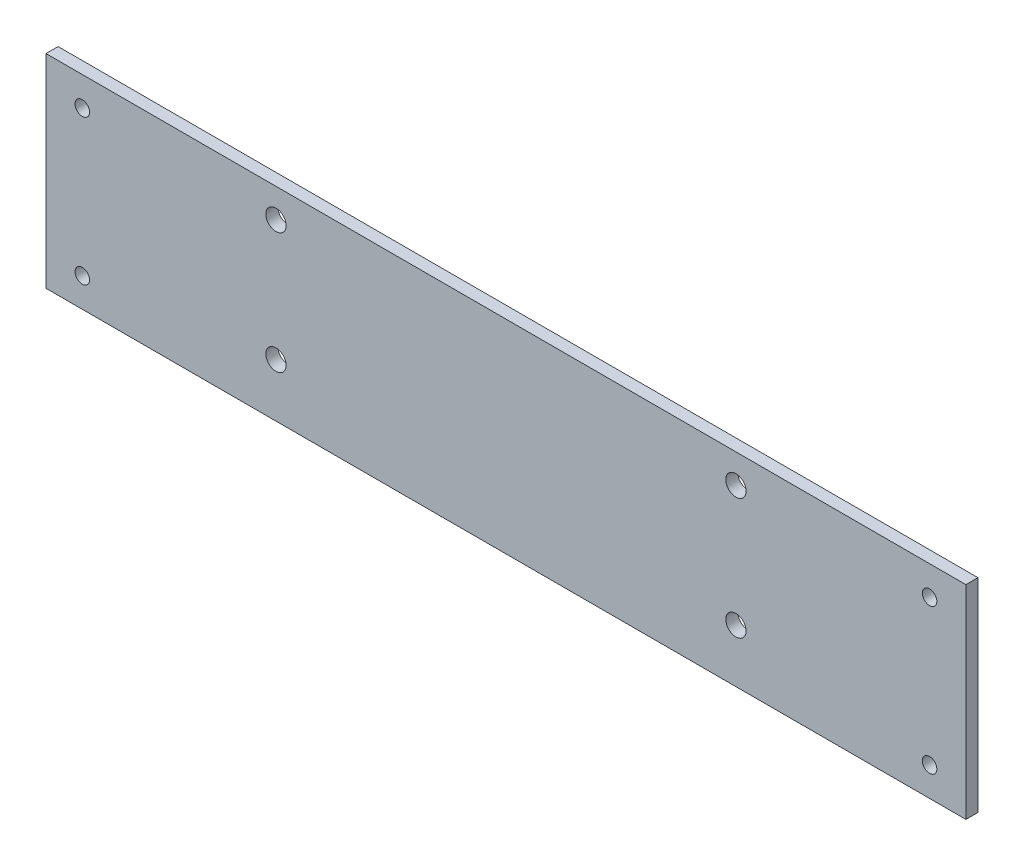
ISO-10303-21;
HEADER;
FILE_DESCRIPTION(('STEP AP214'),'2;1');
FILE_NAME('part.step','',(''),(''),'','','');
FILE_SCHEMA(('AUTOMOTIVE_DESIGN { 1 0 10303 214 1 1 1 1 }'));
ENDSEC;
DATA;
#1=APPLICATION_CONTEXT('core data for automotive mechanical design processes');
#2=APPLICATION_PROTOCOL_DEFINITION('international standard','automotive_design',2000,#1);
#3=PRODUCT_CONTEXT('',#1,'mechanical');
#4=PRODUCT('Part','Part','',(#3));
#5=PRODUCT_RELATED_PRODUCT_CATEGORY('part','',(#4));
#6=PRODUCT_DEFINITION_FORMATION('','',#4);
#7=PRODUCT_DEFINITION_CONTEXT('part definition',#1,'design');
#8=PRODUCT_DEFINITION('design','',#6,#7);
#9=PRODUCT_DEFINITION_SHAPE('','',#8);
#10=(LENGTH_UNIT() NAMED_UNIT(*) SI_UNIT(.MILLI.,.METRE.));
#11=(NAMED_UNIT(*) PLANE_ANGLE_UNIT() SI_UNIT($,.RADIAN.));
#12=(NAMED_UNIT(*) SI_UNIT($,.STERADIAN.) SOLID_ANGLE_UNIT());
#13=UNCERTAINTY_MEASURE_WITH_UNIT(LENGTH_MEASURE(1.E-05),#10,'distance_accuracy_value','');
#14=(GEOMETRIC_REPRESENTATION_CONTEXT(3) GLOBAL_UNCERTAINTY_ASSIGNED_CONTEXT((#13)) GLOBAL_UNIT_ASSIGNED_CONTEXT((#10,
#11,#12)) REPRESENTATION_CONTEXT('',''));
#15=CARTESIAN_POINT('',(0.,0.,0.));
#16=DIRECTION('',(0.,0.,1.));
#17=DIRECTION('',(1.,0.,0.));
#18=AXIS2_PLACEMENT_3D('',#15,#16,#17);
#19=CARTESIAN_POINT('',(-129.225888324873,44.0672588832487,2.5));
#20=DIRECTION('',(1.,0.,0.));
#21=DIRECTION('',(0.,0.,-1.));
#22=AXIS2_PLACEMENT_3D('',#19,#20,#21);
#23=PLANE('',#22);
#24=DIRECTION('',(0.,0.,1.));
#25=VECTOR('',#24,1.);
#26=CARTESIAN_POINT('',(-129.225888324873,40.0672588832487,-7.5));
#27=LINE('',#26,#25);
#28=CARTESIAN_POINT('',(-129.225888324873,40.0672588832487,0.));
#29=VERTEX_POINT('',#28);
#30=CARTESIAN_POINT('',(-129.225888324873,40.0672588832487,2.5));
#31=VERTEX_POINT('',#30);
#32=EDGE_CURVE('E106',#29,#31,#27,.T.);
#33=ORIENTED_EDGE('',*,*,#32,.F.);
#34=DIRECTION('',(0.,-1.,0.));
#35=VECTOR('',#34,1.);
#36=CARTESIAN_POINT('',(-129.225888324873,44.0672588832487,0.));
#37=LINE('',#36,#35);
#38=CARTESIAN_POINT('',(-129.225888324873,-1.93274111675126,0.));
#39=VERTEX_POINT('',#38);
#40=EDGE_CURVE('E97',#29,#39,#37,.T.);
#41=ORIENTED_EDGE('',*,*,#40,.T.);
#42=DIRECTION('',(0.,0.,1.));
#43=VECTOR('',#42,1.);
#44=CARTESIAN_POINT('',(-129.225888324873,-1.93274111675126,-7.5));
#45=LINE('',#44,#43);
#46=CARTESIAN_POINT('',(-129.225888324873,-1.93274111675126,2.5));
#47=VERTEX_POINT('',#46);
#48=EDGE_CURVE('E56',#39,#47,#45,.T.);
#49=ORIENTED_EDGE('',*,*,#48,.T.);
#50=DIRECTION('',(0.,-1.,0.));
#51=VECTOR('',#50,1.);
#52=CARTESIAN_POINT('',(-129.225888324873,44.0672588832487,2.5));
#53=LINE('',#52,#51);
#54=EDGE_CURVE('E88',#31,#47,#53,.T.);
#55=ORIENTED_EDGE('',*,*,#54,.F.);
#56=EDGE_LOOP('',(#33,#41,#49,#55));
#57=FACE_BOUND('',#56,.T.);
#58=ADVANCED_FACE('F35',(#57),#23,.F.);
#59=CARTESIAN_POINT('',(60.7741116751271,44.0672588832487,2.5));
#60=DIRECTION('',(-1.,0.,0.));
#61=DIRECTION('',(0.,-1.,0.));
#62=AXIS2_PLACEMENT_3D('',#59,#60,#61);
#63=PLANE('',#62);
#64=DIRECTION('',(0.,0.,1.));
#65=VECTOR('',#64,1.);
#66=CARTESIAN_POINT('',(60.7741116751271,40.0672588832487,-7.5));
#67=LINE('',#66,#65);
#68=CARTESIAN_POINT('',(60.7741116751271,40.0672588832487,0.));
#69=VERTEX_POINT('',#68);
#70=CARTESIAN_POINT('',(60.7741116751271,40.0672588832487,2.5));
#71=VERTEX_POINT('',#70);
#72=EDGE_CURVE('E48',#69,#71,#67,.T.);
#73=ORIENTED_EDGE('',*,*,#72,.T.);
#74=DIRECTION('',(0.,1.,0.));
#75=VECTOR('',#74,1.);
#76=CARTESIAN_POINT('',(60.7741116751271,44.0672588832487,2.5));
#77=LINE('',#76,#75);
#78=CARTESIAN_POINT('',(60.7741116751271,-1.93274111675126,2.5));
#79=VERTEX_POINT('',#78);
#80=EDGE_CURVE('E86',#79,#71,#77,.T.);
#81=ORIENTED_EDGE('',*,*,#80,.F.);
#82=DIRECTION('',(0.,0.,1.));
#83=VECTOR('',#82,1.);
#84=CARTESIAN_POINT('',(60.7741116751271,-1.93274111675126,-7.5));
#85=LINE('',#84,#83);
#86=CARTESIAN_POINT('',(60.7741116751271,-1.93274111675126,0.));
#87=VERTEX_POINT('',#86);
#88=EDGE_CURVE('E72',#87,#79,#85,.T.);
#89=ORIENTED_EDGE('',*,*,#88,.F.);
#90=DIRECTION('',(0.,1.,0.));
#91=VECTOR('',#90,1.);
#92=CARTESIAN_POINT('',(60.7741116751271,44.0672588832487,0.));
#93=LINE('',#92,#91);
#94=EDGE_CURVE('E93',#87,#69,#93,.T.);
#95=ORIENTED_EDGE('',*,*,#94,.T.);
#96=EDGE_LOOP('',(#73,#81,#89,#95));
#97=FACE_BOUND('',#96,.T.);
#98=ADVANCED_FACE('F91',(#97),#63,.F.);
#99=CARTESIAN_POINT('',(0.,0.,2.5));
#100=DIRECTION('',(0.,0.,1.));
#101=DIRECTION('',(1.,0.,0.));
#102=AXIS2_PLACEMENT_3D('',#99,#100,#101);
#103=PLANE('',#102);
#104=CARTESIAN_POINT('',(-81.7258883248732,9.06725888324874,2.5));
#105=DIRECTION('',(0.,0.,1.));
#106=DIRECTION('',(1.,0.,0.));
#107=AXIS2_PLACEMENT_3D('',#104,#105,#106);
#108=CIRCLE('',#107,2.1);
#109=CARTESIAN_POINT('',(-79.6258883248732,9.06725888324874,2.5));
#110=VERTEX_POINT('',#109);
#111=EDGE_CURVE('E108',#110,#110,#108,.T.);
#112=ORIENTED_EDGE('',*,*,#111,.F.);
#113=EDGE_LOOP('',(#112));
#114=FACE_BOUND('',#113,.T.);
#115=CARTESIAN_POINT('',(13.2741116751268,9.06725888324874,2.5));
#116=DIRECTION('',(0.,0.,1.));
#117=DIRECTION('',(1.,0.,0.));
#118=AXIS2_PLACEMENT_3D('',#115,#116,#117);
#119=CIRCLE('',#118,2.1);
#120=CARTESIAN_POINT('',(15.3741116751268,9.06725888324874,2.5));
#121=VERTEX_POINT('',#120);
#122=EDGE_CURVE('E127',#121,#121,#119,.T.);
#123=ORIENTED_EDGE('',*,*,#122,.F.);
#124=EDGE_LOOP('',(#123));
#125=FACE_BOUND('',#124,.T.);
#126=CARTESIAN_POINT('',(13.2741116751268,34.0672588832488,2.5));
#127=DIRECTION('',(0.,0.,1.));
#128=DIRECTION('',(1.,0.,0.));
#129=AXIS2_PLACEMENT_3D('',#126,#127,#128);
#130=CIRCLE('',#129,2.1);
#131=CARTESIAN_POINT('',(15.3741116751268,34.0672588832488,2.5));
#132=VERTEX_POINT('',#131);
#133=EDGE_CURVE('E121',#132,#132,#130,.T.);
#134=ORIENTED_EDGE('',*,*,#133,.F.);
#135=EDGE_LOOP('',(#134));
#136=FACE_BOUND('',#135,.T.);
#137=CARTESIAN_POINT('',(-81.7258883248732,34.0672588832487,2.5));
#138=DIRECTION('',(0.,0.,1.));
#139=DIRECTION('',(1.,0.,0.));
#140=AXIS2_PLACEMENT_3D('',#137,#138,#139);
#141=CIRCLE('',#140,2.1);
#142=CARTESIAN_POINT('',(-79.6258883248732,34.0672588832487,2.5));
#143=VERTEX_POINT('',#142);
#144=EDGE_CURVE('E120',#143,#143,#141,.T.);
#145=ORIENTED_EDGE('',*,*,#144,.F.);
#146=EDGE_LOOP('',(#145));
#147=FACE_BOUND('',#146,.T.);
#148=CARTESIAN_POINT('',(-121.725888324873,4.06725888324874,2.5));
#149=DIRECTION('',(0.,0.,1.));
#150=DIRECTION('',(1.,0.,0.));
#151=AXIS2_PLACEMENT_3D('',#148,#149,#150);
#152=CIRCLE('',#151,1.5);
#153=CARTESIAN_POINT('',(-120.225888324873,4.06725888324874,2.5));
#154=VERTEX_POINT('',#153);
#155=EDGE_CURVE('E148',#154,#154,#152,.T.);
#156=ORIENTED_EDGE('',*,*,#155,.F.);
#157=EDGE_LOOP('',(#156));
#158=FACE_BOUND('',#157,.T.);
#159=CARTESIAN_POINT('',(53.2741116751271,34.0672588832487,2.5));
#160=DIRECTION('',(0.,0.,1.));
#161=DIRECTION('',(1.,0.,0.));
#162=AXIS2_PLACEMENT_3D('',#159,#160,#161);
#163=CIRCLE('',#162,1.5);
#164=CARTESIAN_POINT('',(54.7741116751271,34.0672588832487,2.5));
#165=VERTEX_POINT('',#164);
#166=EDGE_CURVE('E141',#165,#165,#163,.T.);
#167=ORIENTED_EDGE('',*,*,#166,.F.);
#168=EDGE_LOOP('',(#167));
#169=FACE_BOUND('',#168,.T.);
#170=CARTESIAN_POINT('',(53.2741116751271,4.06725888324874,2.5));
#171=DIRECTION('',(0.,0.,1.));
#172=DIRECTION('',(1.,0.,0.));
#173=AXIS2_PLACEMENT_3D('',#170,#171,#172);
#174=CIRCLE('',#173,1.5);
#175=CARTESIAN_POINT('',(54.7741116751271,4.06725888324874,2.5));
#176=VERTEX_POINT('',#175);
#177=EDGE_CURVE('E135',#176,#176,#174,.T.);
#178=ORIENTED_EDGE('',*,*,#177,.F.);
#179=EDGE_LOOP('',(#178));
#180=FACE_BOUND('',#179,.T.);
#181=CARTESIAN_POINT('',(-121.725888324873,34.0672588832487,2.5));
#182=DIRECTION('',(0.,0.,1.));
#183=DIRECTION('',(1.,0.,0.));
#184=AXIS2_PLACEMENT_3D('',#181,#182,#183);
#185=CIRCLE('',#184,1.5);
#186=CARTESIAN_POINT('',(-120.225888324873,34.0672588832487,2.5));
#187=VERTEX_POINT('',#186);
#188=EDGE_CURVE('E147',#187,#187,#185,.T.);
#189=ORIENTED_EDGE('',*,*,#188,.F.);
#190=EDGE_LOOP('',(#189));
#191=FACE_BOUND('',#190,.T.);
#192=ORIENTED_EDGE('',*,*,#80,.T.);
#193=DIRECTION('',(-1.,0.,0.));
#194=VECTOR('',#193,1.);
#195=CARTESIAN_POINT('',(-129.225888324873,40.0672588832487,2.5));
#196=LINE('',#195,#194);
#197=EDGE_CURVE('E89',#71,#31,#196,.T.);
#198=ORIENTED_EDGE('',*,*,#197,.T.);
#199=ORIENTED_EDGE('',*,*,#54,.T.);
#200=DIRECTION('',(1.,0.,0.));
#201=VECTOR('',#200,1.);
#202=CARTESIAN_POINT('',(-129.225888324873,-1.93274111675126,2.5));
#203=LINE('',#202,#201);
#204=EDGE_CURVE('E75',#47,#79,#203,.T.);
#205=ORIENTED_EDGE('',*,*,#204,.T.);
#206=EDGE_LOOP('',(#192,#198,#199,#205));
#207=FACE_BOUND('',#206,.T.);
#208=ADVANCED_FACE('F84',(#114,#125,#136,#147,#158,#169,#180,#191,#207),#103,.T.);
#209=CARTESIAN_POINT('',(0.,0.,0.));
#210=DIRECTION('',(0.,0.,1.));
#211=DIRECTION('',(1.,0.,0.));
#212=AXIS2_PLACEMENT_3D('',#209,#210,#211);
#213=PLANE('',#212);
#214=CARTESIAN_POINT('',(-81.7258883248732,9.06725888324874,0.));
#215=DIRECTION('',(0.,0.,1.));
#216=DIRECTION('',(1.,0.,0.));
#217=AXIS2_PLACEMENT_3D('',#214,#215,#216);
#218=CIRCLE('',#217,2.1);
#219=CARTESIAN_POINT('',(-79.6258883248732,9.06725888324874,0.));
#220=VERTEX_POINT('',#219);
#221=EDGE_CURVE('E111',#220,#220,#218,.T.);
#222=ORIENTED_EDGE('',*,*,#221,.T.);
#223=EDGE_LOOP('',(#222));
#224=FACE_BOUND('',#223,.T.);
#225=CARTESIAN_POINT('',(13.2741116751268,9.06725888324874,0.));
#226=DIRECTION('',(0.,0.,1.));
#227=DIRECTION('',(1.,0.,0.));
#228=AXIS2_PLACEMENT_3D('',#225,#226,#227);
#229=CIRCLE('',#228,2.1);
#230=CARTESIAN_POINT('',(15.3741116751268,9.06725888324874,0.));
#231=VERTEX_POINT('',#230);
#232=EDGE_CURVE('E124',#231,#231,#229,.T.);
#233=ORIENTED_EDGE('',*,*,#232,.T.);
#234=EDGE_LOOP('',(#233));
#235=FACE_BOUND('',#234,.T.);
#236=CARTESIAN_POINT('',(13.2741116751268,34.0672588832488,0.));
#237=DIRECTION('',(0.,0.,1.));
#238=DIRECTION('',(1.,0.,0.));
#239=AXIS2_PLACEMENT_3D('',#236,#237,#238);
#240=CIRCLE('',#239,2.1);
#241=CARTESIAN_POINT('',(15.3741116751268,34.0672588832488,0.));
#242=VERTEX_POINT('',#241);
#243=EDGE_CURVE('E117',#242,#242,#240,.T.);
#244=ORIENTED_EDGE('',*,*,#243,.T.);
#245=EDGE_LOOP('',(#244));
#246=FACE_BOUND('',#245,.T.);
#247=CARTESIAN_POINT('',(-81.7258883248732,34.0672588832487,0.));
#248=DIRECTION('',(0.,0.,1.));
#249=DIRECTION('',(1.,0.,0.));
#250=AXIS2_PLACEMENT_3D('',#247,#248,#249);
#251=CIRCLE('',#250,2.1);
#252=CARTESIAN_POINT('',(-79.6258883248732,34.0672588832487,0.));
#253=VERTEX_POINT('',#252);
#254=EDGE_CURVE('E132',#253,#253,#251,.T.);
#255=ORIENTED_EDGE('',*,*,#254,.T.);
#256=EDGE_LOOP('',(#255));
#257=FACE_BOUND('',#256,.T.);
#258=CARTESIAN_POINT('',(-121.725888324873,4.06725888324874,0.));
#259=DIRECTION('',(0.,0.,1.));
#260=DIRECTION('',(1.,0.,0.));
#261=AXIS2_PLACEMENT_3D('',#258,#259,#260);
#262=CIRCLE('',#261,1.5);
#263=CARTESIAN_POINT('',(-120.225888324873,4.06725888324874,0.));
#264=VERTEX_POINT('',#263);
#265=EDGE_CURVE('E144',#264,#264,#262,.T.);
#266=ORIENTED_EDGE('',*,*,#265,.T.);
#267=EDGE_LOOP('',(#266));
#268=FACE_BOUND('',#267,.T.);
#269=CARTESIAN_POINT('',(53.2741116751271,34.0672588832487,0.));
#270=DIRECTION('',(0.,0.,1.));
#271=DIRECTION('',(1.,0.,0.));
#272=AXIS2_PLACEMENT_3D('',#269,#270,#271);
#273=CIRCLE('',#272,1.5);
#274=CARTESIAN_POINT('',(54.7741116751271,34.0672588832487,0.));
#275=VERTEX_POINT('',#274);
#276=EDGE_CURVE('E151',#275,#275,#273,.T.);
#277=ORIENTED_EDGE('',*,*,#276,.T.);
#278=EDGE_LOOP('',(#277));
#279=FACE_BOUND('',#278,.T.);
#280=CARTESIAN_POINT('',(53.2741116751271,4.06725888324874,0.));
#281=DIRECTION('',(0.,0.,1.));
#282=DIRECTION('',(1.,0.,0.));
#283=AXIS2_PLACEMENT_3D('',#280,#281,#282);
#284=CIRCLE('',#283,1.5);
#285=CARTESIAN_POINT('',(54.7741116751271,4.06725888324874,0.));
#286=VERTEX_POINT('',#285);
#287=EDGE_CURVE('E138',#286,#286,#284,.T.);
#288=ORIENTED_EDGE('',*,*,#287,.T.);
#289=EDGE_LOOP('',(#288));
#290=FACE_BOUND('',#289,.T.);
#291=CARTESIAN_POINT('',(-121.725888324873,34.0672588832487,0.));
#292=DIRECTION('',(0.,0.,1.));
#293=DIRECTION('',(1.,0.,0.));
#294=AXIS2_PLACEMENT_3D('',#291,#292,#293);
#295=CIRCLE('',#294,1.5);
#296=CARTESIAN_POINT('',(-120.225888324873,34.0672588832487,0.));
#297=VERTEX_POINT('',#296);
#298=EDGE_CURVE('E100',#297,#297,#295,.T.);
#299=ORIENTED_EDGE('',*,*,#298,.T.);
#300=EDGE_LOOP('',(#299));
#301=FACE_BOUND('',#300,.T.);
#302=DIRECTION('',(-1.,0.,0.));
#303=VECTOR('',#302,1.);
#304=CARTESIAN_POINT('',(0.,40.0672588832487,0.));
#305=LINE('',#304,#303);
#306=EDGE_CURVE('E11',#69,#29,#305,.T.);
#307=ORIENTED_EDGE('',*,*,#306,.F.);
#308=ORIENTED_EDGE('',*,*,#94,.F.);
#309=DIRECTION('',(1.,0.,0.));
#310=VECTOR('',#309,1.);
#311=CARTESIAN_POINT('',(0.,-1.93274111675126,0.));
#312=LINE('',#311,#310);
#313=EDGE_CURVE('E42',#39,#87,#312,.T.);
#314=ORIENTED_EDGE('',*,*,#313,.F.);
#315=ORIENTED_EDGE('',*,*,#40,.F.);
#316=EDGE_LOOP('',(#307,#308,#314,#315));
#317=FACE_BOUND('',#316,.T.);
#318=ADVANCED_FACE('F102',(#224,#235,#246,#257,#268,#279,#290,#301,#317),#213,.F.);
#319=CARTESIAN_POINT('',(-121.725888324873,34.0672588832487,0.));
#320=DIRECTION('',(0.,0.,1.));
#321=DIRECTION('',(1.,0.,0.));
#322=AXIS2_PLACEMENT_3D('',#319,#320,#321);
#323=CYLINDRICAL_SURFACE('',#322,1.5);
#324=ORIENTED_EDGE('',*,*,#298,.F.);
#325=EDGE_LOOP('',(#324));
#326=FACE_BOUND('',#325,.T.);
#327=ORIENTED_EDGE('',*,*,#188,.T.);
#328=EDGE_LOOP('',(#327));
#329=FACE_BOUND('',#328,.T.);
#330=ADVANCED_FACE('F160',(#326,#329),#323,.F.);
#331=CARTESIAN_POINT('',(53.2741116751271,4.06725888324874,0.));
#332=DIRECTION('',(0.,0.,1.));
#333=DIRECTION('',(1.,0.,0.));
#334=AXIS2_PLACEMENT_3D('',#331,#332,#333);
#335=CYLINDRICAL_SURFACE('',#334,1.5);
#336=ORIENTED_EDGE('',*,*,#287,.F.);
#337=EDGE_LOOP('',(#336));
#338=FACE_BOUND('',#337,.T.);
#339=ORIENTED_EDGE('',*,*,#177,.T.);
#340=EDGE_LOOP('',(#339));
#341=FACE_BOUND('',#340,.T.);
#342=ADVANCED_FACE('F232',(#338,#341),#335,.F.);
#343=CARTESIAN_POINT('',(53.2741116751271,34.0672588832487,0.));
#344=DIRECTION('',(0.,0.,1.));
#345=DIRECTION('',(1.,0.,0.));
#346=AXIS2_PLACEMENT_3D('',#343,#344,#345);
#347=CYLINDRICAL_SURFACE('',#346,1.5);
#348=ORIENTED_EDGE('',*,*,#276,.F.);
#349=EDGE_LOOP('',(#348));
#350=FACE_BOUND('',#349,.T.);
#351=ORIENTED_EDGE('',*,*,#166,.T.);
#352=EDGE_LOOP('',(#351));
#353=FACE_BOUND('',#352,.T.);
#354=ADVANCED_FACE('F235',(#350,#353),#347,.F.);
#355=CARTESIAN_POINT('',(-121.725888324873,4.06725888324874,0.));
#356=DIRECTION('',(0.,0.,1.));
#357=DIRECTION('',(1.,0.,0.));
#358=AXIS2_PLACEMENT_3D('',#355,#356,#357);
#359=CYLINDRICAL_SURFACE('',#358,1.5);
#360=ORIENTED_EDGE('',*,*,#265,.F.);
#361=EDGE_LOOP('',(#360));
#362=FACE_BOUND('',#361,.T.);
#363=ORIENTED_EDGE('',*,*,#155,.T.);
#364=EDGE_LOOP('',(#363));
#365=FACE_BOUND('',#364,.T.);
#366=ADVANCED_FACE('F230',(#362,#365),#359,.F.);
#367=CARTESIAN_POINT('',(-81.7258883248732,34.0672588832487,0.));
#368=DIRECTION('',(0.,0.,1.));
#369=DIRECTION('',(1.,0.,0.));
#370=AXIS2_PLACEMENT_3D('',#367,#368,#369);
#371=CYLINDRICAL_SURFACE('',#370,2.1);
#372=ORIENTED_EDGE('',*,*,#254,.F.);
#373=EDGE_LOOP('',(#372));
#374=FACE_BOUND('',#373,.T.);
#375=ORIENTED_EDGE('',*,*,#144,.T.);
#376=EDGE_LOOP('',(#375));
#377=FACE_BOUND('',#376,.T.);
#378=ADVANCED_FACE('F221',(#374,#377),#371,.F.);
#379=CARTESIAN_POINT('',(13.2741116751268,34.0672588832488,0.));
#380=DIRECTION('',(0.,0.,1.));
#381=DIRECTION('',(1.,0.,0.));
#382=AXIS2_PLACEMENT_3D('',#379,#380,#381);
#383=CYLINDRICAL_SURFACE('',#382,2.1);
#384=ORIENTED_EDGE('',*,*,#243,.F.);
#385=EDGE_LOOP('',(#384));
#386=FACE_BOUND('',#385,.T.);
#387=ORIENTED_EDGE('',*,*,#133,.T.);
#388=EDGE_LOOP('',(#387));
#389=FACE_BOUND('',#388,.T.);
#390=ADVANCED_FACE('F217',(#386,#389),#383,.F.);
#391=CARTESIAN_POINT('',(13.2741116751268,9.06725888324874,0.));
#392=DIRECTION('',(0.,0.,1.));
#393=DIRECTION('',(1.,0.,0.));
#394=AXIS2_PLACEMENT_3D('',#391,#392,#393);
#395=CYLINDRICAL_SURFACE('',#394,2.1);
#396=ORIENTED_EDGE('',*,*,#232,.F.);
#397=EDGE_LOOP('',(#396));
#398=FACE_BOUND('',#397,.T.);
#399=ORIENTED_EDGE('',*,*,#122,.T.);
#400=EDGE_LOOP('',(#399));
#401=FACE_BOUND('',#400,.T.);
#402=ADVANCED_FACE('F220',(#398,#401),#395,.F.);
#403=CARTESIAN_POINT('',(-81.7258883248732,9.06725888324874,0.));
#404=DIRECTION('',(0.,0.,1.));
#405=DIRECTION('',(1.,0.,0.));
#406=AXIS2_PLACEMENT_3D('',#403,#404,#405);
#407=CYLINDRICAL_SURFACE('',#406,2.1);
#408=ORIENTED_EDGE('',*,*,#221,.F.);
#409=EDGE_LOOP('',(#408));
#410=FACE_BOUND('',#409,.T.);
#411=ORIENTED_EDGE('',*,*,#111,.T.);
#412=EDGE_LOOP('',(#411));
#413=FACE_BOUND('',#412,.T.);
#414=ADVANCED_FACE('F203',(#410,#413),#407,.F.);
#415=CARTESIAN_POINT('',(-129.225888324873,-1.93274111675126,-7.5));
#416=DIRECTION('',(0.,-1.,0.));
#417=DIRECTION('',(1.,0.,0.));
#418=AXIS2_PLACEMENT_3D('',#415,#416,#417);
#419=PLANE('',#418);
#420=ORIENTED_EDGE('',*,*,#313,.T.);
#421=ORIENTED_EDGE('',*,*,#88,.T.);
#422=ORIENTED_EDGE('',*,*,#204,.F.);
#423=ORIENTED_EDGE('',*,*,#48,.F.);
#424=EDGE_LOOP('',(#420,#421,#422,#423));
#425=FACE_BOUND('',#424,.T.);
#426=ADVANCED_FACE('F74',(#425),#419,.T.);
#427=CARTESIAN_POINT('',(-129.225888324873,40.0672588832487,-7.5));
#428=DIRECTION('',(0.,1.,0.));
#429=DIRECTION('',(0.,0.,1.));
#430=AXIS2_PLACEMENT_3D('',#427,#428,#429);
#431=PLANE('',#430);
#432=ORIENTED_EDGE('',*,*,#306,.T.);
#433=ORIENTED_EDGE('',*,*,#32,.T.);
#434=ORIENTED_EDGE('',*,*,#197,.F.);
#435=ORIENTED_EDGE('',*,*,#72,.F.);
#436=EDGE_LOOP('',(#432,#433,#434,#435));
#437=FACE_BOUND('',#436,.T.);
#438=ADVANCED_FACE('F105',(#437),#431,.T.);
#439=CLOSED_SHELL('',(#58,#98,#208,#318,#330,#342,#354,#366,#378,#390,#402,#414,#426,#438));
#440=MANIFOLD_SOLID_BREP('B2',#439);
#441=ADVANCED_BREP_SHAPE_REPRESENTATION('',(#18,#440),#14);
#442=SHAPE_DEFINITION_REPRESENTATION(#9,#441);
ENDSEC;
END-ISO-10303-21;
